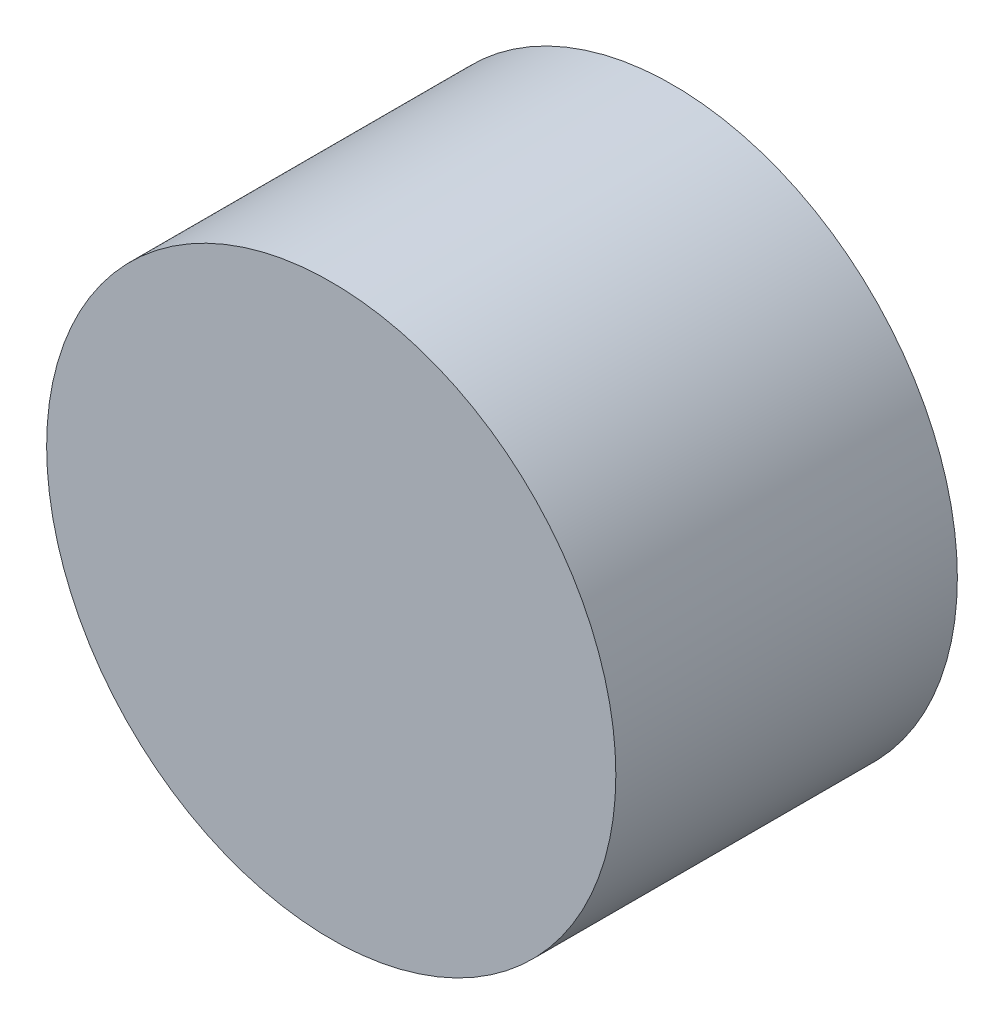
ISO-10303-21;
HEADER;
FILE_DESCRIPTION(('STEP AP214'),'2;1');
FILE_NAME('part.step','',(''),(''),'','','');
FILE_SCHEMA(('AUTOMOTIVE_DESIGN { 1 0 10303 214 1 1 1 1 }'));
ENDSEC;
DATA;
#1=APPLICATION_CONTEXT('core data for automotive mechanical design processes');
#2=APPLICATION_PROTOCOL_DEFINITION('international standard','automotive_design',2000,#1);
#3=PRODUCT_CONTEXT('',#1,'mechanical');
#4=PRODUCT('Part','Part','',(#3));
#5=PRODUCT_RELATED_PRODUCT_CATEGORY('part','',(#4));
#6=PRODUCT_DEFINITION_FORMATION('','',#4);
#7=PRODUCT_DEFINITION_CONTEXT('part definition',#1,'design');
#8=PRODUCT_DEFINITION('design','',#6,#7);
#9=PRODUCT_DEFINITION_SHAPE('','',#8);
#10=(LENGTH_UNIT() NAMED_UNIT(*) SI_UNIT(.MILLI.,.METRE.));
#11=(NAMED_UNIT(*) PLANE_ANGLE_UNIT() SI_UNIT($,.RADIAN.));
#12=(NAMED_UNIT(*) SI_UNIT($,.STERADIAN.) SOLID_ANGLE_UNIT());
#13=UNCERTAINTY_MEASURE_WITH_UNIT(LENGTH_MEASURE(1.E-05),#10,'distance_accuracy_value','');
#14=(GEOMETRIC_REPRESENTATION_CONTEXT(3) GLOBAL_UNCERTAINTY_ASSIGNED_CONTEXT((#13)) GLOBAL_UNIT_ASSIGNED_CONTEXT((#10,
#11,#12)) REPRESENTATION_CONTEXT('',''));
#15=CARTESIAN_POINT('',(0.,0.,0.));
#16=DIRECTION('',(0.,0.,1.));
#17=DIRECTION('',(1.,0.,0.));
#18=AXIS2_PLACEMENT_3D('',#15,#16,#17);
#19=CARTESIAN_POINT('',(0.,0.,-30.));
#20=DIRECTION('',(0.,0.,1.));
#21=DIRECTION('',(-1.,0.,0.));
#22=AXIS2_PLACEMENT_3D('',#19,#20,#21);
#23=CYLINDRICAL_SURFACE('',#22,25.);
#24=CARTESIAN_POINT('',(0.,0.,-30.));
#25=DIRECTION('',(0.,0.,1.));
#26=DIRECTION('',(1.,0.,0.));
#27=AXIS2_PLACEMENT_3D('',#24,#25,#26);
#28=CIRCLE('',#27,25.);
#29=CARTESIAN_POINT('',(25.,0.,-30.));
#30=VERTEX_POINT('',#29);
#31=EDGE_CURVE('E10',#30,#30,#28,.T.);
#32=ORIENTED_EDGE('',*,*,#31,.T.);
#33=EDGE_LOOP('',(#32));
#34=FACE_BOUND('',#33,.T.);
#35=CARTESIAN_POINT('',(0.,0.,0.));
#36=DIRECTION('',(0.,0.,1.));
#37=DIRECTION('',(1.,0.,0.));
#38=AXIS2_PLACEMENT_3D('',#35,#36,#37);
#39=CIRCLE('',#38,25.);
#40=CARTESIAN_POINT('',(25.,0.,0.));
#41=VERTEX_POINT('',#40);
#42=EDGE_CURVE('E36',#41,#41,#39,.T.);
#43=ORIENTED_EDGE('',*,*,#42,.F.);
#44=EDGE_LOOP('',(#43));
#45=FACE_BOUND('',#44,.T.);
#46=ADVANCED_FACE('F33',(#34,#45),#23,.T.);
#47=CARTESIAN_POINT('',(0.,0.,-30.));
#48=DIRECTION('',(0.,0.,-1.));
#49=DIRECTION('',(1.,0.,0.));
#50=AXIS2_PLACEMENT_3D('',#47,#48,#49);
#51=PLANE('',#50);
#52=ORIENTED_EDGE('',*,*,#31,.F.);
#53=EDGE_LOOP('',(#52));
#54=FACE_BOUND('',#53,.T.);
#55=ADVANCED_FACE('F48',(#54),#51,.T.);
#56=CARTESIAN_POINT('',(0.,0.,0.));
#57=DIRECTION('',(0.,0.,-1.));
#58=DIRECTION('',(1.,0.,0.));
#59=AXIS2_PLACEMENT_3D('',#56,#57,#58);
#60=PLANE('',#59);
#61=ORIENTED_EDGE('',*,*,#42,.T.);
#62=EDGE_LOOP('',(#61));
#63=FACE_BOUND('',#62,.T.);
#64=ADVANCED_FACE('F45',(#63),#60,.F.);
#65=CLOSED_SHELL('',(#46,#55,#64));
#66=MANIFOLD_SOLID_BREP('B2',#65);
#67=ADVANCED_BREP_SHAPE_REPRESENTATION('',(#18,#66),#14);
#68=SHAPE_DEFINITION_REPRESENTATION(#9,#67);
ENDSEC;
END-ISO-10303-21;
